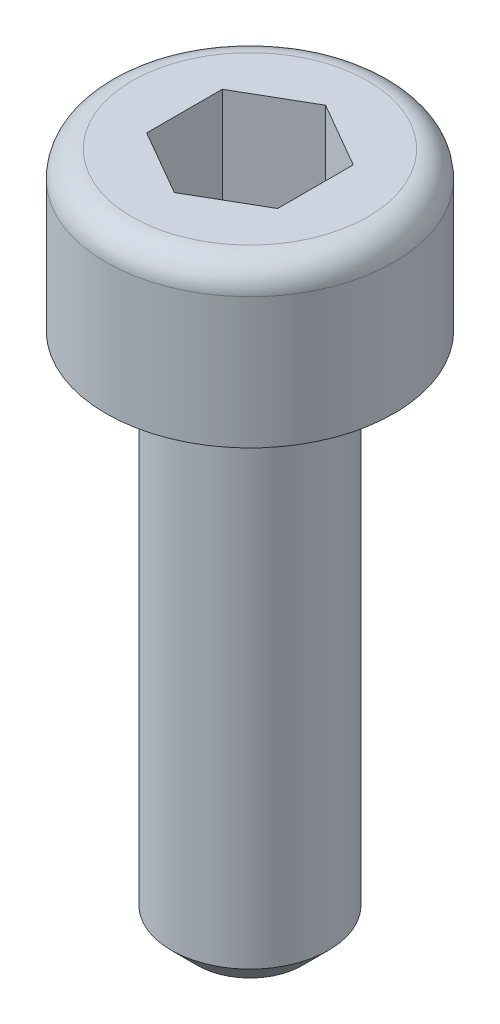
ISO-10303-21;
HEADER;
FILE_DESCRIPTION(('STEP AP214'),'2;1');
FILE_NAME('part.step','',(''),(''),'','','');
FILE_SCHEMA(('AUTOMOTIVE_DESIGN { 1 0 10303 214 1 1 1 1 }'));
ENDSEC;
DATA;
#1=APPLICATION_CONTEXT('core data for automotive mechanical design processes');
#2=APPLICATION_PROTOCOL_DEFINITION('international standard','automotive_design',2000,#1);
#3=PRODUCT_CONTEXT('',#1,'mechanical');
#4=PRODUCT('Part','Part','',(#3));
#5=PRODUCT_RELATED_PRODUCT_CATEGORY('part','',(#4));
#6=PRODUCT_DEFINITION_FORMATION('','',#4);
#7=PRODUCT_DEFINITION_CONTEXT('part definition',#1,'design');
#8=PRODUCT_DEFINITION('design','',#6,#7);
#9=PRODUCT_DEFINITION_SHAPE('','',#8);
#10=(LENGTH_UNIT() NAMED_UNIT(*) SI_UNIT(.MILLI.,.METRE.));
#11=(NAMED_UNIT(*) PLANE_ANGLE_UNIT() SI_UNIT($,.RADIAN.));
#12=(NAMED_UNIT(*) SI_UNIT($,.STERADIAN.) SOLID_ANGLE_UNIT());
#13=UNCERTAINTY_MEASURE_WITH_UNIT(LENGTH_MEASURE(1.E-05),#10,'distance_accuracy_value','');
#14=(GEOMETRIC_REPRESENTATION_CONTEXT(3) GLOBAL_UNCERTAINTY_ASSIGNED_CONTEXT((#13)) GLOBAL_UNIT_ASSIGNED_CONTEXT((#10,
#11,#12)) REPRESENTATION_CONTEXT('',''));
#15=CARTESIAN_POINT('',(0.,0.,0.));
#16=DIRECTION('',(0.,0.,1.));
#17=DIRECTION('',(1.,0.,0.));
#18=AXIS2_PLACEMENT_3D('',#15,#16,#17);
#19=CARTESIAN_POINT('',(0.,0.,0.));
#20=DIRECTION('',(0.,-1.,0.));
#21=DIRECTION('',(0.,0.,-1.));
#22=AXIS2_PLACEMENT_3D('',#19,#20,#21);
#23=PLANE('',#22);
#24=CARTESIAN_POINT('',(0.,0.,0.));
#25=DIRECTION('',(0.,-1.,0.));
#26=DIRECTION('',(0.,0.,-1.));
#27=AXIS2_PLACEMENT_3D('',#24,#25,#26);
#28=CIRCLE('',#27,2.25);
#29=CARTESIAN_POINT('',(0.,0.,-2.25));
#30=VERTEX_POINT('',#29);
#31=EDGE_CURVE('E42',#30,#30,#28,.F.);
#32=ORIENTED_EDGE('',*,*,#31,.T.);
#33=EDGE_LOOP('',(#32));
#34=FACE_BOUND('',#33,.T.);
#35=DIRECTION('',(-0.866025403784439,0.,-0.5));
#36=VECTOR('',#35,1.);
#37=CARTESIAN_POINT('',(1.25,0.,-0.721687836487032));
#38=LINE('',#37,#36);
#39=CARTESIAN_POINT('',(1.25,0.,-0.721687836487032));
#40=VERTEX_POINT('',#39);
#41=CARTESIAN_POINT('',(0.,0.,-1.44337567297406));
#42=VERTEX_POINT('',#41);
#43=EDGE_CURVE('E123',#40,#42,#38,.T.);
#44=ORIENTED_EDGE('',*,*,#43,.F.);
#45=DIRECTION('',(0.,0.,-1.));
#46=VECTOR('',#45,1.);
#47=CARTESIAN_POINT('',(1.25,0.,0.721687836487033));
#48=LINE('',#47,#46);
#49=CARTESIAN_POINT('',(1.25,0.,0.721687836487033));
#50=VERTEX_POINT('',#49);
#51=EDGE_CURVE('E49',#50,#40,#48,.T.);
#52=ORIENTED_EDGE('',*,*,#51,.F.);
#53=DIRECTION('',(0.866025403784439,0.,-0.5));
#54=VECTOR('',#53,1.);
#55=CARTESIAN_POINT('',(0.,0.,1.44337567297406));
#56=LINE('',#55,#54);
#57=CARTESIAN_POINT('',(0.,0.,1.44337567297406));
#58=VERTEX_POINT('',#57);
#59=EDGE_CURVE('E132',#58,#50,#56,.T.);
#60=ORIENTED_EDGE('',*,*,#59,.F.);
#61=DIRECTION('',(0.866025403784439,0.,0.5));
#62=VECTOR('',#61,1.);
#63=CARTESIAN_POINT('',(-1.25,0.,0.721687836487031));
#64=LINE('',#63,#62);
#65=CARTESIAN_POINT('',(-1.25,0.,0.721687836487031));
#66=VERTEX_POINT('',#65);
#67=EDGE_CURVE('E130',#66,#58,#64,.T.);
#68=ORIENTED_EDGE('',*,*,#67,.F.);
#69=DIRECTION('',(0.,0.,1.));
#70=VECTOR('',#69,1.);
#71=CARTESIAN_POINT('',(-1.25,0.,-0.721687836487033));
#72=LINE('',#71,#70);
#73=CARTESIAN_POINT('',(-1.25,0.,-0.721687836487033));
#74=VERTEX_POINT('',#73);
#75=EDGE_CURVE('E97',#74,#66,#72,.T.);
#76=ORIENTED_EDGE('',*,*,#75,.F.);
#77=DIRECTION('',(-0.866025403784439,0.,0.5));
#78=VECTOR('',#77,1.);
#79=CARTESIAN_POINT('',(0.,0.,-1.44337567297406));
#80=LINE('',#79,#78);
#81=EDGE_CURVE('E126',#42,#74,#80,.T.);
#82=ORIENTED_EDGE('',*,*,#81,.F.);
#83=EDGE_LOOP('',(#44,#52,#60,#68,#76,#82));
#84=FACE_BOUND('',#83,.T.);
#85=ADVANCED_FACE('F34',(#34,#84),#23,.F.);
#86=CARTESIAN_POINT('',(0.,0.,0.));
#87=DIRECTION('',(0.,1.,0.));
#88=DIRECTION('',(0.,0.,1.));
#89=AXIS2_PLACEMENT_3D('',#86,#87,#88);
#90=CYLINDRICAL_SURFACE('',#89,2.75);
#91=CARTESIAN_POINT('',(0.,-0.5,0.));
#92=DIRECTION('',(0.,-1.,0.));
#93=DIRECTION('',(0.,0.,-1.));
#94=AXIS2_PLACEMENT_3D('',#91,#92,#93);
#95=CIRCLE('',#94,2.75);
#96=CARTESIAN_POINT('',(0.,-0.5,-2.75));
#97=VERTEX_POINT('',#96);
#98=EDGE_CURVE('E11',#97,#97,#95,.T.);
#99=ORIENTED_EDGE('',*,*,#98,.T.);
#100=EDGE_LOOP('',(#99));
#101=FACE_BOUND('',#100,.T.);
#102=CARTESIAN_POINT('',(0.,-3.,0.));
#103=DIRECTION('',(0.,1.,0.));
#104=DIRECTION('',(0.,0.,1.));
#105=AXIS2_PLACEMENT_3D('',#102,#103,#104);
#106=CIRCLE('',#105,2.75);
#107=CARTESIAN_POINT('',(0.,-3.,2.75));
#108=VERTEX_POINT('',#107);
#109=EDGE_CURVE('E144',#108,#108,#106,.T.);
#110=ORIENTED_EDGE('',*,*,#109,.T.);
#111=EDGE_LOOP('',(#110));
#112=FACE_BOUND('',#111,.T.);
#113=ADVANCED_FACE('F166',(#101,#112),#90,.T.);
#114=CARTESIAN_POINT('',(2.75,-3.,0.));
#115=DIRECTION('',(0.,1.,0.));
#116=DIRECTION('',(0.,0.,1.));
#117=AXIS2_PLACEMENT_3D('',#114,#115,#116);
#118=PLANE('',#117);
#119=ORIENTED_EDGE('',*,*,#109,.F.);
#120=EDGE_LOOP('',(#119));
#121=FACE_BOUND('',#120,.T.);
#122=CARTESIAN_POINT('',(0.,-3.,0.));
#123=DIRECTION('',(0.,1.,0.));
#124=DIRECTION('',(0.,0.,1.));
#125=AXIS2_PLACEMENT_3D('',#122,#123,#124);
#126=CIRCLE('',#125,1.5);
#127=CARTESIAN_POINT('',(0.,-3.,1.5));
#128=VERTEX_POINT('',#127);
#129=EDGE_CURVE('E136',#128,#128,#126,.T.);
#130=ORIENTED_EDGE('',*,*,#129,.T.);
#131=EDGE_LOOP('',(#130));
#132=FACE_BOUND('',#131,.T.);
#133=ADVANCED_FACE('F171',(#121,#132),#118,.F.);
#134=CARTESIAN_POINT('',(0.,0.,0.));
#135=DIRECTION('',(0.,1.,0.));
#136=DIRECTION('',(0.,0.,1.));
#137=AXIS2_PLACEMENT_3D('',#134,#135,#136);
#138=CYLINDRICAL_SURFACE('',#137,1.5);
#139=CARTESIAN_POINT('',(0.,-12.5,0.));
#140=DIRECTION('',(0.,1.,0.));
#141=DIRECTION('',(0.,0.,1.));
#142=AXIS2_PLACEMENT_3D('',#139,#140,#141);
#143=CIRCLE('',#142,1.5);
#144=CARTESIAN_POINT('',(0.,-12.5,1.5));
#145=VERTEX_POINT('',#144);
#146=EDGE_CURVE('E147',#145,#145,#143,.T.);
#147=ORIENTED_EDGE('',*,*,#146,.T.);
#148=EDGE_LOOP('',(#147));
#149=FACE_BOUND('',#148,.T.);
#150=ORIENTED_EDGE('',*,*,#129,.F.);
#151=EDGE_LOOP('',(#150));
#152=FACE_BOUND('',#151,.T.);
#153=ADVANCED_FACE('F177',(#149,#152),#138,.T.);
#154=CARTESIAN_POINT('',(1.5,-13.,0.));
#155=DIRECTION('',(0.,1.,0.));
#156=DIRECTION('',(0.,0.,1.));
#157=AXIS2_PLACEMENT_3D('',#154,#155,#156);
#158=PLANE('',#157);
#159=CARTESIAN_POINT('',(0.,-13.,0.));
#160=DIRECTION('',(0.,1.,0.));
#161=DIRECTION('',(0.,0.,1.));
#162=AXIS2_PLACEMENT_3D('',#159,#160,#161);
#163=CIRCLE('',#162,0.999999999999998);
#164=CARTESIAN_POINT('',(0.,-13.,0.999999999999998));
#165=VERTEX_POINT('',#164);
#166=EDGE_CURVE('E150',#165,#165,#163,.F.);
#167=ORIENTED_EDGE('',*,*,#166,.T.);
#168=EDGE_LOOP('',(#167));
#169=FACE_BOUND('',#168,.T.);
#170=ADVANCED_FACE('F181',(#169),#158,.F.);
#171=CARTESIAN_POINT('',(1.25,-2.,0.721687836487033));
#172=DIRECTION('',(1.,0.,0.));
#173=DIRECTION('',(0.,0.,-1.));
#174=AXIS2_PLACEMENT_3D('',#171,#172,#173);
#175=PLANE('',#174);
#176=ORIENTED_EDGE('',*,*,#51,.T.);
#177=DIRECTION('',(0.,1.,0.));
#178=VECTOR('',#177,1.);
#179=CARTESIAN_POINT('',(1.25,-2.,-0.721687836487032));
#180=LINE('',#179,#178);
#181=CARTESIAN_POINT('',(1.25,-2.,-0.721687836487032));
#182=VERTEX_POINT('',#181);
#183=EDGE_CURVE('E79',#182,#40,#180,.T.);
#184=ORIENTED_EDGE('',*,*,#183,.F.);
#185=DIRECTION('',(0.,0.,-1.));
#186=VECTOR('',#185,1.);
#187=CARTESIAN_POINT('',(1.25,-2.,0.721687836487033));
#188=LINE('',#187,#186);
#189=CARTESIAN_POINT('',(1.25,-2.,0.721687836487033));
#190=VERTEX_POINT('',#189);
#191=EDGE_CURVE('E134',#190,#182,#188,.T.);
#192=ORIENTED_EDGE('',*,*,#191,.F.);
#193=DIRECTION('',(0.,1.,0.));
#194=VECTOR('',#193,1.);
#195=CARTESIAN_POINT('',(1.25,-2.,0.721687836487033));
#196=LINE('',#195,#194);
#197=EDGE_CURVE('E57',#190,#50,#196,.T.);
#198=ORIENTED_EDGE('',*,*,#197,.T.);
#199=EDGE_LOOP('',(#176,#184,#192,#198));
#200=FACE_BOUND('',#199,.T.);
#201=ADVANCED_FACE('F185',(#200),#175,.F.);
#202=CARTESIAN_POINT('',(0.,-2.,1.44337567297406));
#203=DIRECTION('',(0.5,0.,0.866025403784439));
#204=DIRECTION('',(0.866025403784439,0.,-0.5));
#205=AXIS2_PLACEMENT_3D('',#202,#203,#204);
#206=PLANE('',#205);
#207=ORIENTED_EDGE('',*,*,#59,.T.);
#208=ORIENTED_EDGE('',*,*,#197,.F.);
#209=DIRECTION('',(0.866025403784439,0.,-0.5));
#210=VECTOR('',#209,1.);
#211=CARTESIAN_POINT('',(0.,-2.,1.44337567297406));
#212=LINE('',#211,#210);
#213=CARTESIAN_POINT('',(0.,-2.,1.44337567297406));
#214=VERTEX_POINT('',#213);
#215=EDGE_CURVE('E109',#214,#190,#212,.T.);
#216=ORIENTED_EDGE('',*,*,#215,.F.);
#217=DIRECTION('',(0.,1.,0.));
#218=VECTOR('',#217,1.);
#219=CARTESIAN_POINT('',(0.,-2.,1.44337567297406));
#220=LINE('',#219,#218);
#221=EDGE_CURVE('E101',#214,#58,#220,.T.);
#222=ORIENTED_EDGE('',*,*,#221,.T.);
#223=EDGE_LOOP('',(#207,#208,#216,#222));
#224=FACE_BOUND('',#223,.T.);
#225=ADVANCED_FACE('F189',(#224),#206,.F.);
#226=CARTESIAN_POINT('',(-1.25,-2.,0.721687836487031));
#227=DIRECTION('',(-0.5,0.,0.866025403784439));
#228=DIRECTION('',(0.866025403784439,0.,0.5));
#229=AXIS2_PLACEMENT_3D('',#226,#227,#228);
#230=PLANE('',#229);
#231=ORIENTED_EDGE('',*,*,#67,.T.);
#232=ORIENTED_EDGE('',*,*,#221,.F.);
#233=DIRECTION('',(0.866025403784439,0.,0.5));
#234=VECTOR('',#233,1.);
#235=CARTESIAN_POINT('',(-1.25,-2.,0.721687836487031));
#236=LINE('',#235,#234);
#237=CARTESIAN_POINT('',(-1.25,-2.,0.721687836487031));
#238=VERTEX_POINT('',#237);
#239=EDGE_CURVE('E105',#238,#214,#236,.T.);
#240=ORIENTED_EDGE('',*,*,#239,.F.);
#241=DIRECTION('',(0.,1.,0.));
#242=VECTOR('',#241,1.);
#243=CARTESIAN_POINT('',(-1.25,-2.,0.721687836487031));
#244=LINE('',#243,#242);
#245=EDGE_CURVE('E90',#238,#66,#244,.T.);
#246=ORIENTED_EDGE('',*,*,#245,.T.);
#247=EDGE_LOOP('',(#231,#232,#240,#246));
#248=FACE_BOUND('',#247,.T.);
#249=ADVANCED_FACE('F106',(#248),#230,.F.);
#250=CARTESIAN_POINT('',(-1.25,-2.,-0.721687836487033));
#251=DIRECTION('',(-1.,0.,0.));
#252=DIRECTION('',(0.,0.,1.));
#253=AXIS2_PLACEMENT_3D('',#250,#251,#252);
#254=PLANE('',#253);
#255=ORIENTED_EDGE('',*,*,#75,.T.);
#256=ORIENTED_EDGE('',*,*,#245,.F.);
#257=DIRECTION('',(0.,0.,1.));
#258=VECTOR('',#257,1.);
#259=CARTESIAN_POINT('',(-1.25,-2.,-0.721687836487033));
#260=LINE('',#259,#258);
#261=CARTESIAN_POINT('',(-1.25,-2.,-0.721687836487033));
#262=VERTEX_POINT('',#261);
#263=EDGE_CURVE('E94',#262,#238,#260,.T.);
#264=ORIENTED_EDGE('',*,*,#263,.F.);
#265=DIRECTION('',(0.,1.,0.));
#266=VECTOR('',#265,1.);
#267=CARTESIAN_POINT('',(-1.25,-2.,-0.721687836487033));
#268=LINE('',#267,#266);
#269=EDGE_CURVE('E102',#262,#74,#268,.T.);
#270=ORIENTED_EDGE('',*,*,#269,.T.);
#271=EDGE_LOOP('',(#255,#256,#264,#270));
#272=FACE_BOUND('',#271,.T.);
#273=ADVANCED_FACE('F92',(#272),#254,.F.);
#274=CARTESIAN_POINT('',(0.,-2.,-1.44337567297406));
#275=DIRECTION('',(-0.5,0.,-0.866025403784439));
#276=DIRECTION('',(-0.866025403784439,0.,0.5));
#277=AXIS2_PLACEMENT_3D('',#274,#275,#276);
#278=PLANE('',#277);
#279=ORIENTED_EDGE('',*,*,#81,.T.);
#280=ORIENTED_EDGE('',*,*,#269,.F.);
#281=DIRECTION('',(-0.866025403784439,0.,0.5));
#282=VECTOR('',#281,1.);
#283=CARTESIAN_POINT('',(0.,-2.,-1.44337567297406));
#284=LINE('',#283,#282);
#285=CARTESIAN_POINT('',(0.,-2.,-1.44337567297406));
#286=VERTEX_POINT('',#285);
#287=EDGE_CURVE('E115',#286,#262,#284,.T.);
#288=ORIENTED_EDGE('',*,*,#287,.F.);
#289=DIRECTION('',(0.,1.,0.));
#290=VECTOR('',#289,1.);
#291=CARTESIAN_POINT('',(0.,-2.,-1.44337567297406));
#292=LINE('',#291,#290);
#293=EDGE_CURVE('E139',#286,#42,#292,.T.);
#294=ORIENTED_EDGE('',*,*,#293,.T.);
#295=EDGE_LOOP('',(#279,#280,#288,#294));
#296=FACE_BOUND('',#295,.T.);
#297=ADVANCED_FACE('F193',(#296),#278,.F.);
#298=CARTESIAN_POINT('',(1.25,-2.,-0.721687836487032));
#299=DIRECTION('',(0.5,0.,-0.866025403784439));
#300=DIRECTION('',(-0.866025403784439,0.,-0.5));
#301=AXIS2_PLACEMENT_3D('',#298,#299,#300);
#302=PLANE('',#301);
#303=ORIENTED_EDGE('',*,*,#43,.T.);
#304=ORIENTED_EDGE('',*,*,#293,.F.);
#305=DIRECTION('',(-0.866025403784439,0.,-0.5));
#306=VECTOR('',#305,1.);
#307=CARTESIAN_POINT('',(1.25,-2.,-0.721687836487032));
#308=LINE('',#307,#306);
#309=EDGE_CURVE('E117',#182,#286,#308,.T.);
#310=ORIENTED_EDGE('',*,*,#309,.F.);
#311=ORIENTED_EDGE('',*,*,#183,.T.);
#312=EDGE_LOOP('',(#303,#304,#310,#311));
#313=FACE_BOUND('',#312,.T.);
#314=ADVANCED_FACE('F190',(#313),#302,.F.);
#315=CARTESIAN_POINT('',(1.25,-2.,-0.721687836487032));
#316=DIRECTION('',(0.,1.,0.));
#317=DIRECTION('',(0.,0.,1.));
#318=AXIS2_PLACEMENT_3D('',#315,#316,#317);
#319=PLANE('',#318);
#320=ORIENTED_EDGE('',*,*,#191,.T.);
#321=ORIENTED_EDGE('',*,*,#309,.T.);
#322=ORIENTED_EDGE('',*,*,#287,.T.);
#323=ORIENTED_EDGE('',*,*,#263,.T.);
#324=ORIENTED_EDGE('',*,*,#239,.T.);
#325=ORIENTED_EDGE('',*,*,#215,.T.);
#326=EDGE_LOOP('',(#320,#321,#322,#323,#324,#325));
#327=FACE_BOUND('',#326,.T.);
#328=ADVANCED_FACE('F112',(#327),#319,.T.);
#329=CARTESIAN_POINT('',(0.,-12.5,0.));
#330=DIRECTION('',(0.,1.,0.));
#331=DIRECTION('',(0.,0.,1.));
#332=AXIS2_PLACEMENT_3D('',#329,#330,#331);
#333=CONICAL_SURFACE('',#332,1.5,0.785398163397451);
#334=ORIENTED_EDGE('',*,*,#166,.F.);
#335=EDGE_LOOP('',(#334));
#336=FACE_BOUND('',#335,.T.);
#337=ORIENTED_EDGE('',*,*,#146,.F.);
#338=EDGE_LOOP('',(#337));
#339=FACE_BOUND('',#338,.T.);
#340=ADVANCED_FACE('F158',(#336,#339),#333,.T.);
#341=CARTESIAN_POINT('',(0.,-0.5,0.));
#342=DIRECTION('',(0.,-1.,0.));
#343=DIRECTION('',(0.,0.,-1.));
#344=AXIS2_PLACEMENT_3D('',#341,#342,#343);
#345=TOROIDAL_SURFACE('',#344,2.25,0.5);
#346=ORIENTED_EDGE('',*,*,#98,.F.);
#347=EDGE_LOOP('',(#346));
#348=FACE_BOUND('',#347,.T.);
#349=ORIENTED_EDGE('',*,*,#31,.F.);
#350=EDGE_LOOP('',(#349));
#351=FACE_BOUND('',#350,.T.);
#352=ADVANCED_FACE('F36',(#348,#351),#345,.T.);
#353=CLOSED_SHELL('',(#85,#113,#133,#153,#170,#201,#225,#249,#273,#297,#314,#328,#340,#352));
#354=MANIFOLD_SOLID_BREP('B2',#353);
#355=ADVANCED_BREP_SHAPE_REPRESENTATION('',(#18,#354),#14);
#356=SHAPE_DEFINITION_REPRESENTATION(#9,#355);
ENDSEC;
END-ISO-10303-21;
